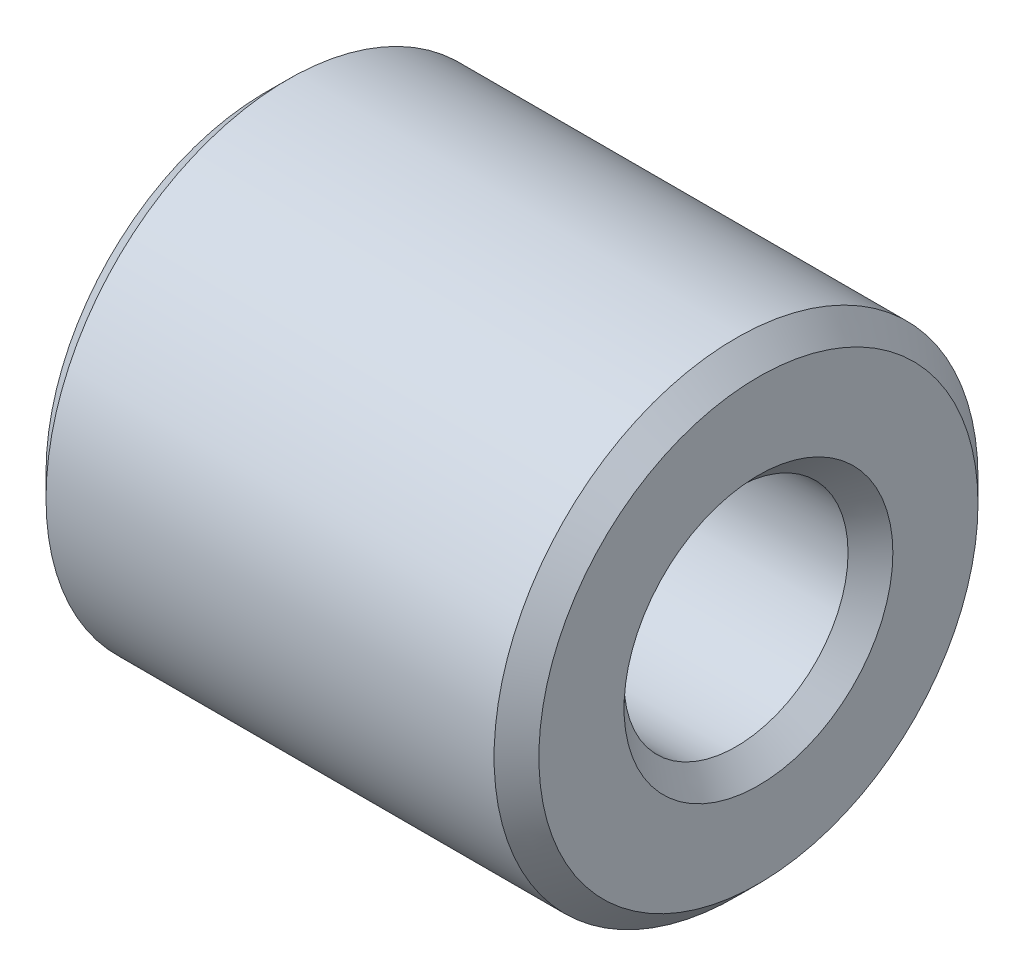
ISO-10303-21;
HEADER;
FILE_DESCRIPTION(('STEP AP214'),'2;1');
FILE_NAME('part.step','',(''),(''),'','','');
FILE_SCHEMA(('AUTOMOTIVE_DESIGN { 1 0 10303 214 1 1 1 1 }'));
ENDSEC;
DATA;
#1=APPLICATION_CONTEXT('core data for automotive mechanical design processes');
#2=APPLICATION_PROTOCOL_DEFINITION('international standard','automotive_design',2000,#1);
#3=PRODUCT_CONTEXT('',#1,'mechanical');
#4=PRODUCT('Part','Part','',(#3));
#5=PRODUCT_RELATED_PRODUCT_CATEGORY('part','',(#4));
#6=PRODUCT_DEFINITION_FORMATION('','',#4);
#7=PRODUCT_DEFINITION_CONTEXT('part definition',#1,'design');
#8=PRODUCT_DEFINITION('design','',#6,#7);
#9=PRODUCT_DEFINITION_SHAPE('','',#8);
#10=(LENGTH_UNIT() NAMED_UNIT(*) SI_UNIT(.MILLI.,.METRE.));
#11=(NAMED_UNIT(*) PLANE_ANGLE_UNIT() SI_UNIT($,.RADIAN.));
#12=(NAMED_UNIT(*) SI_UNIT($,.STERADIAN.) SOLID_ANGLE_UNIT());
#13=UNCERTAINTY_MEASURE_WITH_UNIT(LENGTH_MEASURE(1.E-05),#10,'distance_accuracy_value','');
#14=(GEOMETRIC_REPRESENTATION_CONTEXT(3) GLOBAL_UNCERTAINTY_ASSIGNED_CONTEXT((#13)) GLOBAL_UNIT_ASSIGNED_CONTEXT((#10,
#11,#12)) REPRESENTATION_CONTEXT('',''));
#15=CARTESIAN_POINT('',(0.,0.,0.));
#16=DIRECTION('',(0.,0.,1.));
#17=DIRECTION('',(1.,0.,0.));
#18=AXIS2_PLACEMENT_3D('',#15,#16,#17);
#19=CARTESIAN_POINT('',(-5.5,5.40000000000873,0.));
#20=DIRECTION('',(-1.,0.,0.));
#21=DIRECTION('',(0.,0.,1.));
#22=AXIS2_PLACEMENT_3D('',#19,#20,#21);
#23=PLANE('',#22);
#24=CARTESIAN_POINT('',(-5.5,0.,0.));
#25=DIRECTION('',(-1.,0.,0.));
#26=DIRECTION('',(0.,0.,1.));
#27=AXIS2_PLACEMENT_3D('',#24,#25,#26);
#28=CIRCLE('',#27,4.90000000000872);
#29=CARTESIAN_POINT('',(-5.5,0.,4.90000000000872));
#30=VERTEX_POINT('',#29);
#31=EDGE_CURVE('E53',#30,#30,#28,.T.);
#32=ORIENTED_EDGE('',*,*,#31,.T.);
#33=EDGE_LOOP('',(#32));
#34=FACE_BOUND('',#33,.T.);
#35=CARTESIAN_POINT('',(-5.5,0.,0.));
#36=DIRECTION('',(-1.,0.,0.));
#37=DIRECTION('',(0.,0.,1.));
#38=AXIS2_PLACEMENT_3D('',#35,#36,#37);
#39=CIRCLE('',#38,3.);
#40=CARTESIAN_POINT('',(-5.5,0.,3.));
#41=VERTEX_POINT('',#40);
#42=EDGE_CURVE('E56',#41,#41,#39,.F.);
#43=ORIENTED_EDGE('',*,*,#42,.T.);
#44=EDGE_LOOP('',(#43));
#45=FACE_BOUND('',#44,.T.);
#46=ADVANCED_FACE('F33',(#34,#45),#23,.T.);
#47=CARTESIAN_POINT('',(0.,0.,0.));
#48=DIRECTION('',(1.,0.,0.));
#49=DIRECTION('',(0.,0.,-1.));
#50=AXIS2_PLACEMENT_3D('',#47,#48,#49);
#51=CYLINDRICAL_SURFACE('',#50,2.5);
#52=CARTESIAN_POINT('',(-5.,0.,0.));
#53=DIRECTION('',(-1.,0.,0.));
#54=DIRECTION('',(0.,0.,1.));
#55=AXIS2_PLACEMENT_3D('',#52,#53,#54);
#56=CIRCLE('',#55,2.5);
#57=CARTESIAN_POINT('',(-5.,0.,2.5));
#58=VERTEX_POINT('',#57);
#59=EDGE_CURVE('E10',#58,#58,#56,.T.);
#60=ORIENTED_EDGE('',*,*,#59,.T.);
#61=EDGE_LOOP('',(#60));
#62=FACE_BOUND('',#61,.T.);
#63=CARTESIAN_POINT('',(4.99999999999999,0.,0.));
#64=DIRECTION('',(1.,0.,0.));
#65=DIRECTION('',(0.,0.,-1.));
#66=AXIS2_PLACEMENT_3D('',#63,#64,#65);
#67=CIRCLE('',#66,2.5);
#68=CARTESIAN_POINT('',(4.99999999999999,0.,-2.5));
#69=VERTEX_POINT('',#68);
#70=EDGE_CURVE('E40',#69,#69,#67,.T.);
#71=ORIENTED_EDGE('',*,*,#70,.T.);
#72=EDGE_LOOP('',(#71));
#73=FACE_BOUND('',#72,.T.);
#74=CARTESIAN_POINT('',(-2.75,-2.,1.5));
#75=CARTESIAN_POINT('',(-2.67452102471036,-1.99999416642512,1.50000404108592));
#76=CARTESIAN_POINT('',(-2.5990615659202,-2.00433633903481,1.49426852824013));
#77=CARTESIAN_POINT('',(-2.45067609603778,-2.02092590613883,1.47174965152787));
#78=CARTESIAN_POINT('',(-2.3777528126149,-2.03318155043097,1.45495475788936));
#79=CARTESIAN_POINT('',(-2.23691635832272,-2.0636233903473,1.41143486335795));
#80=CARTESIAN_POINT('',(-2.16897116196473,-2.0817666618312,1.3847815450315));
#81=CARTESIAN_POINT('',(-2.03856254663208,-2.12185904995836,1.32252909283019));
#82=CARTESIAN_POINT('',(-1.97610077030486,-2.14380930122416,1.28692729054693));
#83=CARTESIAN_POINT('',(-1.85005098333591,-2.19228594587542,1.20271292747644));
#84=CARTESIAN_POINT('',(-1.78725904287605,-2.21904371037662,1.15304179435289));
#85=CARTESIAN_POINT('',(-1.67023523725824,-2.27226229431061,1.04426801309985));
#86=CARTESIAN_POINT('',(-1.61600984832919,-2.29872287517103,0.985158296729613));
#87=CARTESIAN_POINT('',(-1.5118661902903,-2.35175567858734,0.851442367411702));
#88=CARTESIAN_POINT('',(-1.46304553633025,-2.37803133577818,0.775851995162548));
#89=CARTESIAN_POINT('',(-1.37919027755556,-2.42443786983179,0.615654228271659));
#90=CARTESIAN_POINT('',(-1.34414302587728,-2.44457437988735,0.531055196626331));
#91=CARTESIAN_POINT('',(-1.29240407718735,-2.4747098780044,0.363771406742667));
#92=CARTESIAN_POINT('',(-1.2742796390327,-2.4854930393917,0.281674698130916));
#93=CARTESIAN_POINT('',(-1.25205719713688,-2.49874939277545,0.114970509382709));
#94=CARTESIAN_POINT('',(-1.24794602199994,-2.50123038813308,0.0303654624001538));
#95=CARTESIAN_POINT('',(-1.25361374734246,-2.49783372711539,-0.127637283737309));
#96=CARTESIAN_POINT('',(-1.26173352616931,-2.49295437513726,-0.201123832865634));
#97=CARTESIAN_POINT('',(-1.2884797956481,-2.47707997553857,-0.345464269151768));
#98=CARTESIAN_POINT('',(-1.30710706390715,-2.46608447529309,-0.416317961051201));
#99=CARTESIAN_POINT('',(-1.35416556270377,-2.4388490720172,-0.554056780469079));
#100=CARTESIAN_POINT('',(-1.38265306113899,-2.42257910450824,-0.620916491037617));
#101=CARTESIAN_POINT('',(-1.44838461622554,-2.38609637638748,-0.748988660115611));
#102=CARTESIAN_POINT('',(-1.48563094705901,-2.36588259201812,-0.810199646208011));
#103=CARTESIAN_POINT('',(-1.57283909280445,-2.32037925976363,-0.933074267143199));
#104=CARTESIAN_POINT('',(-1.62378831173573,-2.2947718295215,-0.993918663198193));
#105=CARTESIAN_POINT('',(-1.73440411786017,-2.24255554245601,-1.10671465909275));
#106=CARTESIAN_POINT('',(-1.7940825034745,-2.21594536703375,-1.1586540130834));
#107=CARTESIAN_POINT('',(-1.92865340616355,-2.16111075123946,-1.25824837767417));
#108=CARTESIAN_POINT('',(-2.00450757653946,-2.13305661385124,-1.30470933188632));
#109=CARTESIAN_POINT('',(-2.1647062316366,-2.08250879557267,-1.38397217194232));
#110=CARTESIAN_POINT('',(-2.24903471612564,-2.06000490298821,-1.41679921962189));
#111=CARTESIAN_POINT('',(-2.40239363189534,-2.02895865196732,-1.46077497064842));
#112=CARTESIAN_POINT('',(-2.47004063229664,-2.01833888618316,-1.47527903312665));
#113=CARTESIAN_POINT('',(-2.60737361029948,-2.00392150777558,-1.49480872755284));
#114=CARTESIAN_POINT('',(-2.67705712048456,-2.00011596115116,-1.49984538302907));
#115=CARTESIAN_POINT('',(-2.8165516824357,-1.99988914321323,-1.50014781114183));
#116=CARTESIAN_POINT('',(-2.88636277721521,-2.00347810223984,-1.49540004697659));
#117=CARTESIAN_POINT('',(-3.02398734374855,-2.01751520788652,-1.47640290574941));
#118=CARTESIAN_POINT('',(-3.09179919224025,-2.02796877613213,-1.46214601830139));
#119=CARTESIAN_POINT('',(-3.22371457947978,-2.05431768333101,-1.42488312618657));
#120=CARTESIAN_POINT('',(-3.28782263653223,-2.07020622092812,-1.40188805257362));
#121=CARTESIAN_POINT('',(-3.41147771573018,-2.10571539417587,-1.34796261057072));
#122=CARTESIAN_POINT('',(-3.471023006366,-2.12533743689999,-1.31702924888212));
#123=CARTESIAN_POINT('',(-3.59524008251224,-2.17036819177737,-1.24167439558512));
#124=CARTESIAN_POINT('',(-3.65890083509656,-2.19618239397369,-1.19582663060303));
#125=CARTESIAN_POINT('',(-3.77828548484946,-2.24821754803621,-1.09487395518701));
#126=CARTESIAN_POINT('',(-3.83400169216911,-2.27443886711455,-1.03976018672402));
#127=CARTESIAN_POINT('',(-3.94322400735042,-2.32835625910913,-0.913274837212767));
#128=CARTESIAN_POINT('',(-3.99550072660583,-2.3558007587587,-0.840721108780193));
#129=CARTESIAN_POINT('',(-4.08690277683665,-2.40537639133459,-0.686103100868021));
#130=CARTESIAN_POINT('',(-4.12603682784092,-2.42751104449411,-0.604045176134704));
#131=CARTESIAN_POINT('',(-4.18686820343136,-2.46252280092775,-0.43884023297214));
#132=CARTESIAN_POINT('',(-4.2096262277911,-2.47595588067329,-0.35620596365126));
#133=CARTESIAN_POINT('',(-4.24071460284625,-2.494407389061,-0.187383063890858));
#134=CARTESIAN_POINT('',(-4.24906129071762,-2.49943534582737,-0.10119857178197));
#135=CARTESIAN_POINT('',(-4.25067460858592,-2.50040600461976,0.0598120232009829));
#136=CARTESIAN_POINT('',(-4.24580333456303,-2.49747057186327,0.134620583589705));
#137=CARTESIAN_POINT('',(-4.22510617561838,-2.48512948412096,0.282148755978773));
#138=CARTESIAN_POINT('',(-4.2092801686784,-2.47572375706639,0.354868344701913));
#139=CARTESIAN_POINT('',(-4.16778042841621,-2.45149427526962,0.495145481978796));
#140=CARTESIAN_POINT('',(-4.14226840387075,-2.43675966858906,0.562767032608829));
#141=CARTESIAN_POINT('',(-4.08235940544524,-2.40303337447155,0.692781971999983));
#142=CARTESIAN_POINT('',(-4.0479604391404,-2.38404073252268,0.755174184199831));
#143=CARTESIAN_POINT('',(-3.96707480343124,-2.34093432659381,0.880263645295947));
#144=CARTESIAN_POINT('',(-3.91968129098313,-2.31648844639149,0.942258690439939));
#145=CARTESIAN_POINT('',(-3.81624696628227,-2.26601907350661,1.05789751536307));
#146=CARTESIAN_POINT('',(-3.76019657439209,-2.23999385274509,1.11153190956916));
#147=CARTESIAN_POINT('',(-3.6327144378223,-2.18528165666205,1.2159097535057));
#148=CARTESIAN_POINT('',(-3.5602335138345,-2.15667566270901,1.26542406663367));
#149=CARTESIAN_POINT('',(-3.40651514723346,-2.10376464485145,1.35156817210325));
#150=CARTESIAN_POINT('',(-3.32528228601858,-2.07945738811052,1.38820466322661));
#151=CARTESIAN_POINT('',(-3.1629357148628,-2.0408000304796,1.44437116535132));
#152=CARTESIAN_POINT('',(-3.08240476403875,-2.02577665830138,1.46509526060187));
#153=CARTESIAN_POINT('',(-2.91790260529632,-2.00539032320036,1.49289268240426));
#154=CARTESIAN_POINT('',(-2.83393923424129,-2.00000648744643,1.49999550595837));
#155=CARTESIAN_POINT('',(-2.75,-2.,1.5));
#156=B_SPLINE_CURVE_WITH_KNOTS('',3,(#74,#75,#76,#77,#78,#79,#80,#81,#82,#83,#84,#85,#86,#87,
#88,#89,#90,#91,#92,#93,#94,#95,#96,#97,#98,#99,#100,#101,#102,#103,#104,#105,#106,#107,#108,
#109,#110,#111,#112,#113,#114,#115,#116,#117,#118,#119,#120,#121,#122,#123,#124,#125,#126,#127,
#128,#129,#130,#131,#132,#133,#134,#135,#136,#137,#138,#139,#140,#141,#142,#143,#144,#145,#146,
#147,#148,#149,#150,#151,#152,#153,#154,#155),.UNSPECIFIED.,.T.,.F.,(4,2,2,2,2,2,2,2,2,2,2,2,2,
2,2,2,2,2,2,2,2,2,2,2,2,2,2,2,2,2,2,2,2,2,2,2,2,2,2,2,4),(0.,0.226085249493392,0.45240657433077,
0.677113624991876,0.901887762215932,1.15414462390001,1.40659128601844,1.68630157736223,
1.9657544327122,2.21853330858497,2.47107452602766,2.69230130543181,2.91354445887944,
3.13607155036377,3.35865648368878,3.60782810055849,3.85733966656908,4.13576671140276,
4.41367760154768,4.62276298054684,4.83160475643976,5.04073566011181,5.25003193304128,
5.45906724365495,5.6681814915466,5.91499438482002,6.16204457978454,6.44121828011588,
6.72020638384847,6.97891479383337,7.23732973022726,7.46129321849399,7.68525920139648,
7.90563970188756,8.12606965394584,8.37042963549487,8.61506198741954,8.89071695766603,
9.16622832484805,9.41820120134354,9.66962780912277),.UNSPECIFIED.);
#157=CARTESIAN_POINT('',(-2.75,-2.,1.5));
#158=VERTEX_POINT('',#157);
#159=EDGE_CURVE('E65',#158,#158,#156,.T.);
#160=ORIENTED_EDGE('',*,*,#159,.F.);
#161=EDGE_LOOP('',(#160));
#162=FACE_BOUND('',#161,.T.);
#163=ADVANCED_FACE('F97',(#62,#73,#162),#51,.F.);
#164=CARTESIAN_POINT('',(5.5,2.5,0.));
#165=DIRECTION('',(1.,0.,0.));
#166=DIRECTION('',(0.,0.,-1.));
#167=AXIS2_PLACEMENT_3D('',#164,#165,#166);
#168=PLANE('',#167);
#169=CARTESIAN_POINT('',(5.5,0.,0.));
#170=DIRECTION('',(1.,0.,0.));
#171=DIRECTION('',(0.,0.,-1.));
#172=AXIS2_PLACEMENT_3D('',#169,#170,#171);
#173=CIRCLE('',#172,4.90000000000001);
#174=CARTESIAN_POINT('',(5.5,0.,-4.90000000000001));
#175=VERTEX_POINT('',#174);
#176=EDGE_CURVE('E44',#175,#175,#173,.T.);
#177=ORIENTED_EDGE('',*,*,#176,.T.);
#178=EDGE_LOOP('',(#177));
#179=FACE_BOUND('',#178,.T.);
#180=CARTESIAN_POINT('',(5.5,0.,0.));
#181=DIRECTION('',(1.,0.,0.));
#182=DIRECTION('',(0.,0.,-1.));
#183=AXIS2_PLACEMENT_3D('',#180,#181,#182);
#184=CIRCLE('',#183,3.00000000000001);
#185=CARTESIAN_POINT('',(5.5,0.,-3.00000000000001));
#186=VERTEX_POINT('',#185);
#187=EDGE_CURVE('E48',#186,#186,#184,.F.);
#188=ORIENTED_EDGE('',*,*,#187,.T.);
#189=EDGE_LOOP('',(#188));
#190=FACE_BOUND('',#189,.T.);
#191=ADVANCED_FACE('F92',(#179,#190),#168,.T.);
#192=CARTESIAN_POINT('',(0.,0.,0.));
#193=DIRECTION('',(1.,0.,0.));
#194=DIRECTION('',(0.,0.,-1.));
#195=AXIS2_PLACEMENT_3D('',#192,#193,#194);
#196=CYLINDRICAL_SURFACE('',#195,5.40000000000437);
#197=CARTESIAN_POINT('',(-5.00000000000436,0.,0.));
#198=DIRECTION('',(-1.,0.,0.));
#199=DIRECTION('',(0.,0.,1.));
#200=AXIS2_PLACEMENT_3D('',#197,#198,#199);
#201=CIRCLE('',#200,5.40000000000437);
#202=CARTESIAN_POINT('',(-5.00000000000436,0.,5.40000000000437));
#203=VERTEX_POINT('',#202);
#204=EDGE_CURVE('E59',#203,#203,#201,.F.);
#205=ORIENTED_EDGE('',*,*,#204,.T.);
#206=EDGE_LOOP('',(#205));
#207=FACE_BOUND('',#206,.T.);
#208=CARTESIAN_POINT('',(4.99999999999564,0.,0.));
#209=DIRECTION('',(1.,0.,0.));
#210=DIRECTION('',(0.,0.,-1.));
#211=AXIS2_PLACEMENT_3D('',#208,#209,#210);
#212=CIRCLE('',#211,5.40000000000437);
#213=CARTESIAN_POINT('',(4.99999999999564,0.,-5.40000000000437));
#214=VERTEX_POINT('',#213);
#215=EDGE_CURVE('E62',#214,#214,#212,.F.);
#216=ORIENTED_EDGE('',*,*,#215,.T.);
#217=EDGE_LOOP('',(#216));
#218=FACE_BOUND('',#217,.T.);
#219=CARTESIAN_POINT('',(-2.75,-5.18748493974172,1.5));
#220=CARTESIAN_POINT('',(-2.83249217197288,-5.18748622496865,1.49999828997893));
#221=CARTESIAN_POINT('',(-2.91500194404355,-5.18947416562418,1.49317186455125));
#222=CARTESIAN_POINT('',(-3.07762915725902,-5.19718484444262,1.46610416230309));
#223=CARTESIAN_POINT('',(-3.15774551316669,-5.20290925072281,1.44585689378444));
#224=CARTESIAN_POINT('',(-3.31320939605564,-5.21739561254167,1.39267205208465));
#225=CARTESIAN_POINT('',(-3.38856382445221,-5.22615304713724,1.35975335846573));
#226=CARTESIAN_POINT('',(-3.53269455323329,-5.24571285037754,1.2822202645049));
#227=CARTESIAN_POINT('',(-3.60147018457129,-5.25651542667574,1.23760467634159));
#228=CARTESIAN_POINT('',(-3.73235711334973,-5.27927689347648,1.13664919144528));
#229=CARTESIAN_POINT('',(-3.79426347058173,-5.29125765324372,1.08004846722559));
#230=CARTESIAN_POINT('',(-3.90783850342363,-5.31483743889174,0.95728972176013));
#231=CARTESIAN_POINT('',(-3.95950603997902,-5.32643642218086,0.891130638574293));
#232=CARTESIAN_POINT('',(-4.05200267669675,-5.34819121645625,0.749700257343555));
#233=CARTESIAN_POINT('',(-4.09262635510666,-5.35831823056814,0.674289796566457));
#234=CARTESIAN_POINT('',(-4.16053956425583,-5.37573610988217,0.517380217229614));
#235=CARTESIAN_POINT('',(-4.18783154274439,-5.38302749566599,0.435882219534496));
#236=CARTESIAN_POINT('',(-4.22763856728356,-5.39379791004685,0.271251816123478));
#237=CARTESIAN_POINT('',(-4.24050262535678,-5.39736682830859,0.18820978504017));
#238=CARTESIAN_POINT('',(-4.25218847399362,-5.40060520431005,0.0210746741271951));
#239=CARTESIAN_POINT('',(-4.25101280693403,-5.40027536805396,-0.0630182126537084));
#240=CARTESIAN_POINT('',(-4.2348946685697,-5.39581851824967,-0.227432548291574));
#241=CARTESIAN_POINT('',(-4.22032954161855,-5.39179558845596,-0.30779424602711));
#242=CARTESIAN_POINT('',(-4.17845771706045,-5.38052856059855,-0.464884489993547));
#243=CARTESIAN_POINT('',(-4.15115026360693,-5.37328427145216,-0.541612820403715));
#244=CARTESIAN_POINT('',(-4.08429075165008,-5.35623750364187,-0.690200155079756));
#245=CARTESIAN_POINT('',(-4.04461285428539,-5.34640890471048,-0.761999415952795));
#246=CARTESIAN_POINT('',(-3.95423623050809,-5.32524732810488,-0.898046743853025));
#247=CARTESIAN_POINT('',(-3.90353520038476,-5.31391403615982,-0.962293228104146));
#248=CARTESIAN_POINT('',(-3.79056280533357,-5.29052197936227,-1.08366405622945));
#249=CARTESIAN_POINT('',(-3.72796291661244,-5.2784516217314,-1.14048075035395));
#250=CARTESIAN_POINT('',(-3.59400039492663,-5.25528229891571,-1.24288864851073));
#251=CARTESIAN_POINT('',(-3.52263712992901,-5.24418340389377,-1.28847904216537));
#252=CARTESIAN_POINT('',(-3.3724611671524,-5.22416408366817,-1.36740142873179));
#253=CARTESIAN_POINT('',(-3.29359863841585,-5.21525988041426,-1.400643009846));
#254=CARTESIAN_POINT('',(-3.13109384254531,-5.20083613494949,-1.45329178586143));
#255=CARTESIAN_POINT('',(-3.0474528846519,-5.19531567044487,-1.47270275075953));
#256=CARTESIAN_POINT('',(-2.88065929160698,-5.18848288999461,-1.49659473291661));
#257=CARTESIAN_POINT('',(-2.79757805912314,-5.18704047793293,-1.50153749605341));
#258=CARTESIAN_POINT('',(-2.63177480573341,-5.18816993237047,-1.49763055236889));
#259=CARTESIAN_POINT('',(-2.5490527439876,-5.19074132981579,-1.48878245714788));
#260=CARTESIAN_POINT('',(-2.3881413519799,-5.19948233947086,-1.45795344857036));
#261=CARTESIAN_POINT('',(-2.30989299869018,-5.20557412095343,-1.43625635918597));
#262=CARTESIAN_POINT('',(-2.15814786374076,-5.22059198495345,-1.38066755512992));
#263=CARTESIAN_POINT('',(-2.0846517423685,-5.22951846031647,-1.34677415014729));
#264=CARTESIAN_POINT('',(-1.94258277886484,-5.24946217449307,-1.26683742729491));
#265=CARTESIAN_POINT('',(-1.87416693737686,-5.26052375913245,-1.22052640358921));
#266=CARTESIAN_POINT('',(-1.74590825355455,-5.28338999646947,-1.11739633108476));
#267=CARTESIAN_POINT('',(-1.68606716920124,-5.29519480082865,-1.06057513296388));
#268=CARTESIAN_POINT('',(-1.57470711765881,-5.31867011963912,-0.935890461880191));
#269=CARTESIAN_POINT('',(-1.52351191395924,-5.33032452777974,-0.867734159225758));
#270=CARTESIAN_POINT('',(-1.43328561735346,-5.35180441727636,-0.723529867721558));
#271=CARTESIAN_POINT('',(-1.39425387992342,-5.36162999552819,-0.647482297302964));
#272=CARTESIAN_POINT('',(-1.32983024490591,-5.37828196672925,-0.490187037139812));
#273=CARTESIAN_POINT('',(-1.30433530035963,-5.38513094388068,-0.408984060630256));
#274=CARTESIAN_POINT('',(-1.26741909593552,-5.39515765703777,-0.243225787737071));
#275=CARTESIAN_POINT('',(-1.25599443011381,-5.39833628150143,-0.158671307757621));
#276=CARTESIAN_POINT('',(-1.24777140218823,-5.40061825326042,0.00837609141473693));
#277=CARTESIAN_POINT('',(-1.25049997574563,-5.39985341392262,0.0908442387539525));
#278=CARTESIAN_POINT('',(-1.26939713749437,-5.39463653308314,0.254100371836764));
#279=CARTESIAN_POINT('',(-1.28556514254192,-5.39018465156415,0.334888430324377));
#280=CARTESIAN_POINT('',(-1.33060593417708,-5.37812390455248,0.491870990081798));
#281=CARTESIAN_POINT('',(-1.35937555876034,-5.37054070162526,0.568097193769064));
#282=CARTESIAN_POINT('',(-1.42871116293844,-5.35300692178699,0.714683524729812));
#283=CARTESIAN_POINT('',(-1.46927890002601,-5.34305599221037,0.785042776028537));
#284=CARTESIAN_POINT('',(-1.5624031656308,-5.32149238409908,0.920070673038475));
#285=CARTESIAN_POINT('',(-1.6152680516461,-5.30984047043841,0.984520359885339));
#286=CARTESIAN_POINT('',(-1.73091075826628,-5.28633552481111,1.10379338143919));
#287=CARTESIAN_POINT('',(-1.79369125881077,-5.27448243924807,1.15861410519644));
#288=CARTESIAN_POINT('',(-1.92922671048298,-5.25158132130768,1.25840545145803));
#289=CARTESIAN_POINT('',(-2.00218783378422,-5.24056002364518,1.30310278053283));
#290=CARTESIAN_POINT('',(-2.15488639237315,-5.22096231494335,1.37953591591594));
#291=CARTESIAN_POINT('',(-2.23461972392625,-5.21238443680146,1.41127950501387));
#292=CARTESIAN_POINT('',(-2.38661607783051,-5.19972807453774,1.45715696928586));
#293=CARTESIAN_POINT('',(-2.45827364333058,-5.19517596404652,1.4731833804337));
#294=CARTESIAN_POINT('',(-2.60328298893804,-5.18905403082368,1.49460492295236));
#295=CARTESIAN_POINT('',(-2.67663453392844,-5.18748379670874,1.50000152082906));
#296=CARTESIAN_POINT('',(-2.75,-5.18748493974172,1.5));
#297=B_SPLINE_CURVE_WITH_KNOTS('',3,(#219,#220,#221,#222,#223,#224,#225,#226,#227,#228,#229,
#230,#231,#232,#233,#234,#235,#236,#237,#238,#239,#240,#241,#242,#243,#244,#245,#246,#247,#248,
#249,#250,#251,#252,#253,#254,#255,#256,#257,#258,#259,#260,#261,#262,#263,#264,#265,#266,#267,
#268,#269,#270,#271,#272,#273,#274,#275,#276,#277,#278,#279,#280,#281,#282,#283,#284,#285,#286,
#287,#288,#289,#290,#291,#292,#293,#294,#295,#296),.UNSPECIFIED.,.T.,.F.,(4,2,2,2,2,2,2,2,2,2,2,
2,2,2,2,2,2,2,2,2,2,2,2,2,2,2,2,2,2,2,2,2,2,2,2,2,2,2,4),(0.,0.247206475013384,
0.494523389072726,0.74147323516717,0.988448168775734,1.24148337456022,1.49454671437447,
1.75203718050381,2.00948035264756,2.26055178734846,2.51157775759035,2.75573920510853,
2.99991513758438,3.24666079982064,3.49345807877747,3.74845725330897,4.00347482972527,
4.26032434444616,4.51710381943139,4.76559382658774,5.01405479736817,5.25722206615908,
5.50042304896036,5.74936000582743,5.99834792649559,6.25522503755615,6.51208853476869,
6.76696759518504,7.02178494577107,7.26814118838277,7.51448674202904,7.75885223919389,
8.00325415665561,8.25461213670037,8.50603816906631,8.76360527674968,9.02101740583075,
9.24090397774495,9.4607602116337),.UNSPECIFIED.);
#298=CARTESIAN_POINT('',(-2.75,-5.18748493974172,1.5));
#299=VERTEX_POINT('',#298);
#300=EDGE_CURVE('E66',#299,#299,#297,.T.);
#301=ORIENTED_EDGE('',*,*,#300,.F.);
#302=EDGE_LOOP('',(#301));
#303=FACE_BOUND('',#302,.T.);
#304=ADVANCED_FACE('F76',(#207,#218,#303),#196,.T.);
#305=CARTESIAN_POINT('',(-2.75,-10.,0.));
#306=DIRECTION('',(0.,1.,0.));
#307=DIRECTION('',(0.,0.,1.));
#308=AXIS2_PLACEMENT_3D('',#305,#306,#307);
#309=CYLINDRICAL_SURFACE('',#308,1.5);
#310=ORIENTED_EDGE('',*,*,#159,.T.);
#311=EDGE_LOOP('',(#310));
#312=FACE_BOUND('',#311,.T.);
#313=ORIENTED_EDGE('',*,*,#300,.T.);
#314=EDGE_LOOP('',(#313));
#315=FACE_BOUND('',#314,.T.);
#316=ADVANCED_FACE('F79',(#312,#315),#309,.F.);
#317=CARTESIAN_POINT('',(-5.00000000000436,0.,0.));
#318=DIRECTION('',(1.,0.,0.));
#319=DIRECTION('',(0.,0.,-1.));
#320=AXIS2_PLACEMENT_3D('',#317,#318,#319);
#321=CONICAL_SURFACE('',#320,5.40000000000437,0.785398163397448);
#322=ORIENTED_EDGE('',*,*,#31,.F.);
#323=EDGE_LOOP('',(#322));
#324=FACE_BOUND('',#323,.T.);
#325=ORIENTED_EDGE('',*,*,#204,.F.);
#326=EDGE_LOOP('',(#325));
#327=FACE_BOUND('',#326,.T.);
#328=ADVANCED_FACE('F82',(#324,#327),#321,.T.);
#329=CARTESIAN_POINT('',(5.5,0.,0.));
#330=DIRECTION('',(-1.,0.,0.));
#331=DIRECTION('',(0.,0.,1.));
#332=AXIS2_PLACEMENT_3D('',#329,#330,#331);
#333=CONICAL_SURFACE('',#332,4.90000000000001,0.785398163397448);
#334=ORIENTED_EDGE('',*,*,#215,.F.);
#335=EDGE_LOOP('',(#334));
#336=FACE_BOUND('',#335,.T.);
#337=ORIENTED_EDGE('',*,*,#176,.F.);
#338=EDGE_LOOP('',(#337));
#339=FACE_BOUND('',#338,.T.);
#340=ADVANCED_FACE('F89',(#336,#339),#333,.T.);
#341=CARTESIAN_POINT('',(-5.5,0.,0.));
#342=DIRECTION('',(-1.,0.,0.));
#343=DIRECTION('',(0.,0.,1.));
#344=AXIS2_PLACEMENT_3D('',#341,#342,#343);
#345=CONICAL_SURFACE('',#344,3.,0.785398163397446);
#346=ORIENTED_EDGE('',*,*,#59,.F.);
#347=EDGE_LOOP('',(#346));
#348=FACE_BOUND('',#347,.T.);
#349=ORIENTED_EDGE('',*,*,#42,.F.);
#350=EDGE_LOOP('',(#349));
#351=FACE_BOUND('',#350,.T.);
#352=ADVANCED_FACE('F107',(#348,#351),#345,.F.);
#353=CARTESIAN_POINT('',(4.99999999999999,0.,0.));
#354=DIRECTION('',(1.,0.,0.));
#355=DIRECTION('',(0.,0.,-1.));
#356=AXIS2_PLACEMENT_3D('',#353,#354,#355);
#357=CONICAL_SURFACE('',#356,2.5,0.785398163397453);
#358=ORIENTED_EDGE('',*,*,#187,.F.);
#359=EDGE_LOOP('',(#358));
#360=FACE_BOUND('',#359,.T.);
#361=ORIENTED_EDGE('',*,*,#70,.F.);
#362=EDGE_LOOP('',(#361));
#363=FACE_BOUND('',#362,.T.);
#364=ADVANCED_FACE('F35',(#360,#363),#357,.F.);
#365=CLOSED_SHELL('',(#46,#163,#191,#304,#316,#328,#340,#352,#364));
#366=MANIFOLD_SOLID_BREP('B2',#365);
#367=ADVANCED_BREP_SHAPE_REPRESENTATION('',(#18,#366),#14);
#368=SHAPE_DEFINITION_REPRESENTATION(#9,#367);
ENDSEC;
END-ISO-10303-21;
